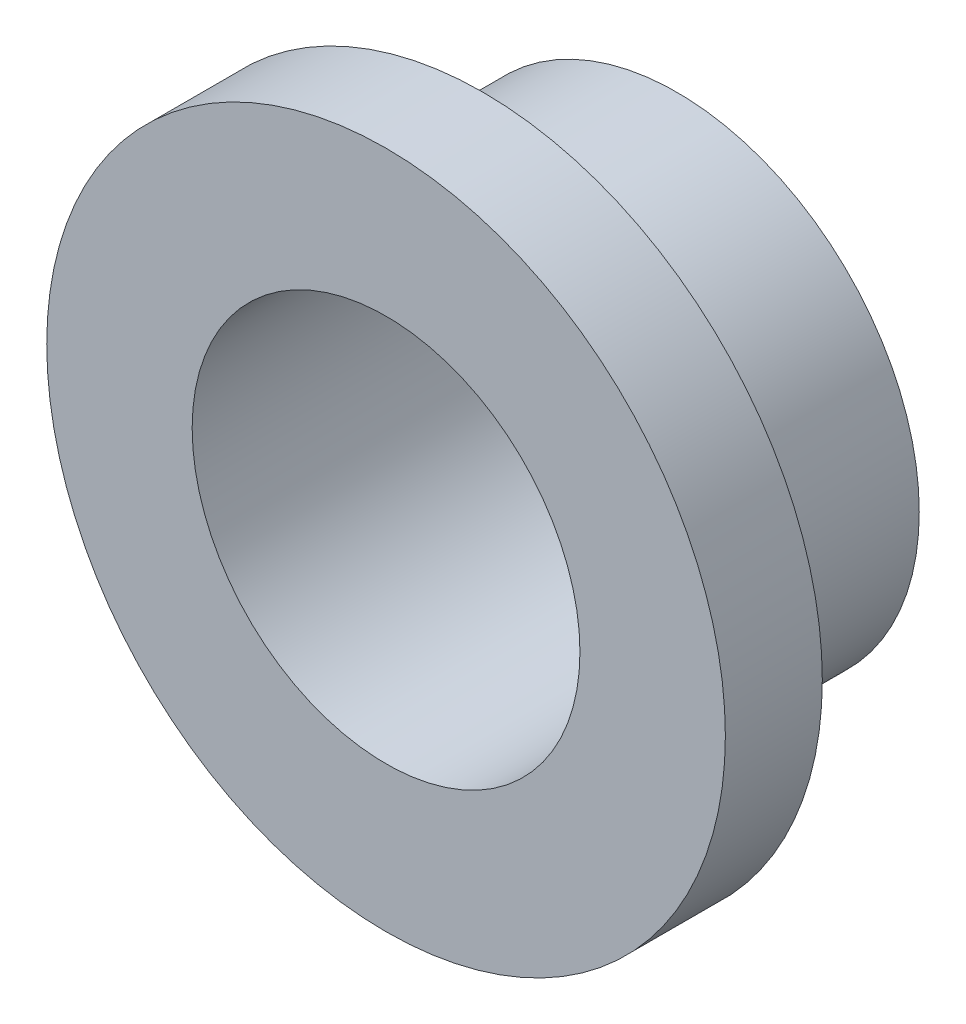
ISO-10303-21;
HEADER;
FILE_DESCRIPTION(('STEP AP214'),'2;1');
FILE_NAME('part.step','',(''),(''),'','','');
FILE_SCHEMA(('AUTOMOTIVE_DESIGN { 1 0 10303 214 1 1 1 1 }'));
ENDSEC;
DATA;
#1=APPLICATION_CONTEXT('core data for automotive mechanical design processes');
#2=APPLICATION_PROTOCOL_DEFINITION('international standard','automotive_design',2000,#1);
#3=PRODUCT_CONTEXT('',#1,'mechanical');
#4=PRODUCT('Part','Part','',(#3));
#5=PRODUCT_RELATED_PRODUCT_CATEGORY('part','',(#4));
#6=PRODUCT_DEFINITION_FORMATION('','',#4);
#7=PRODUCT_DEFINITION_CONTEXT('part definition',#1,'design');
#8=PRODUCT_DEFINITION('design','',#6,#7);
#9=PRODUCT_DEFINITION_SHAPE('','',#8);
#10=(LENGTH_UNIT() NAMED_UNIT(*) SI_UNIT(.MILLI.,.METRE.));
#11=(NAMED_UNIT(*) PLANE_ANGLE_UNIT() SI_UNIT($,.RADIAN.));
#12=(NAMED_UNIT(*) SI_UNIT($,.STERADIAN.) SOLID_ANGLE_UNIT());
#13=UNCERTAINTY_MEASURE_WITH_UNIT(LENGTH_MEASURE(1.E-05),#10,'distance_accuracy_value','');
#14=(GEOMETRIC_REPRESENTATION_CONTEXT(3) GLOBAL_UNCERTAINTY_ASSIGNED_CONTEXT((#13)) GLOBAL_UNIT_ASSIGNED_CONTEXT((#10,
#11,#12)) REPRESENTATION_CONTEXT('',''));
#15=CARTESIAN_POINT('',(0.,0.,0.));
#16=DIRECTION('',(0.,0.,1.));
#17=DIRECTION('',(1.,0.,0.));
#18=AXIS2_PLACEMENT_3D('',#15,#16,#17);
#19=CARTESIAN_POINT('',(0.,0.,9.525));
#20=DIRECTION('',(0.,0.,-1.));
#21=DIRECTION('',(-1.,0.,0.));
#22=AXIS2_PLACEMENT_3D('',#19,#20,#21);
#23=CYLINDRICAL_SURFACE('',#22,7.9375);
#24=CARTESIAN_POINT('',(0.,0.,0.));
#25=DIRECTION('',(0.,0.,1.));
#26=DIRECTION('',(1.,0.,0.));
#27=AXIS2_PLACEMENT_3D('',#24,#25,#26);
#28=CIRCLE('',#27,7.9375);
#29=CARTESIAN_POINT('',(7.9375,0.,0.));
#30=VERTEX_POINT('',#29);
#31=EDGE_CURVE('E34',#30,#30,#28,.T.);
#32=ORIENTED_EDGE('',*,*,#31,.T.);
#33=EDGE_LOOP('',(#32));
#34=FACE_BOUND('',#33,.T.);
#35=CARTESIAN_POINT('',(0.,0.,6.35));
#36=DIRECTION('',(0.,0.,1.));
#37=DIRECTION('',(1.,0.,0.));
#38=AXIS2_PLACEMENT_3D('',#35,#36,#37);
#39=CIRCLE('',#38,7.9375);
#40=CARTESIAN_POINT('',(7.9375,0.,6.35));
#41=VERTEX_POINT('',#40);
#42=EDGE_CURVE('E10',#41,#41,#39,.T.);
#43=ORIENTED_EDGE('',*,*,#42,.F.);
#44=EDGE_LOOP('',(#43));
#45=FACE_BOUND('',#44,.T.);
#46=ADVANCED_FACE('F31',(#34,#45),#23,.T.);
#47=CARTESIAN_POINT('',(0.,0.,9.525));
#48=DIRECTION('',(0.,0.,1.));
#49=DIRECTION('',(1.,0.,0.));
#50=AXIS2_PLACEMENT_3D('',#47,#48,#49);
#51=PLANE('',#50);
#52=CARTESIAN_POINT('',(0.,0.,9.525));
#53=DIRECTION('',(0.,0.,1.));
#54=DIRECTION('',(1.,0.,0.));
#55=AXIS2_PLACEMENT_3D('',#52,#53,#54);
#56=CIRCLE('',#55,6.35);
#57=CARTESIAN_POINT('',(6.35,0.,9.525));
#58=VERTEX_POINT('',#57);
#59=EDGE_CURVE('E42',#58,#58,#56,.T.);
#60=ORIENTED_EDGE('',*,*,#59,.F.);
#61=EDGE_LOOP('',(#60));
#62=FACE_BOUND('',#61,.T.);
#63=CARTESIAN_POINT('',(0.,0.,9.525));
#64=DIRECTION('',(0.,0.,1.));
#65=DIRECTION('',(1.,0.,0.));
#66=AXIS2_PLACEMENT_3D('',#63,#64,#65);
#67=CIRCLE('',#66,11.1125);
#68=CARTESIAN_POINT('',(11.1125,0.,9.525));
#69=VERTEX_POINT('',#68);
#70=EDGE_CURVE('E45',#69,#69,#67,.T.);
#71=ORIENTED_EDGE('',*,*,#70,.T.);
#72=EDGE_LOOP('',(#71));
#73=FACE_BOUND('',#72,.T.);
#74=ADVANCED_FACE('F59',(#62,#73),#51,.T.);
#75=CARTESIAN_POINT('',(0.,0.,0.));
#76=DIRECTION('',(0.,0.,1.));
#77=DIRECTION('',(1.,0.,0.));
#78=AXIS2_PLACEMENT_3D('',#75,#76,#77);
#79=PLANE('',#78);
#80=ORIENTED_EDGE('',*,*,#31,.F.);
#81=EDGE_LOOP('',(#80));
#82=FACE_BOUND('',#81,.T.);
#83=CARTESIAN_POINT('',(0.,0.,0.));
#84=DIRECTION('',(0.,0.,1.));
#85=DIRECTION('',(1.,0.,0.));
#86=AXIS2_PLACEMENT_3D('',#83,#84,#85);
#87=CIRCLE('',#86,6.35);
#88=CARTESIAN_POINT('',(6.35,0.,0.));
#89=VERTEX_POINT('',#88);
#90=EDGE_CURVE('E48',#89,#89,#87,.T.);
#91=ORIENTED_EDGE('',*,*,#90,.T.);
#92=EDGE_LOOP('',(#91));
#93=FACE_BOUND('',#92,.T.);
#94=ADVANCED_FACE('F77',(#82,#93),#79,.F.);
#95=CARTESIAN_POINT('',(0.,0.,9.525));
#96=DIRECTION('',(0.,0.,-1.));
#97=DIRECTION('',(-1.,0.,0.));
#98=AXIS2_PLACEMENT_3D('',#95,#96,#97);
#99=CYLINDRICAL_SURFACE('',#98,6.35);
#100=ORIENTED_EDGE('',*,*,#59,.T.);
#101=EDGE_LOOP('',(#100));
#102=FACE_BOUND('',#101,.T.);
#103=ORIENTED_EDGE('',*,*,#90,.F.);
#104=EDGE_LOOP('',(#103));
#105=FACE_BOUND('',#104,.T.);
#106=ADVANCED_FACE('F68',(#102,#105),#99,.F.);
#107=CARTESIAN_POINT('',(0.,0.,6.35));
#108=DIRECTION('',(0.,0.,1.));
#109=DIRECTION('',(1.,0.,0.));
#110=AXIS2_PLACEMENT_3D('',#107,#108,#109);
#111=PLANE('',#110);
#112=CARTESIAN_POINT('',(0.,0.,6.35));
#113=DIRECTION('',(0.,0.,1.));
#114=DIRECTION('',(1.,0.,0.));
#115=AXIS2_PLACEMENT_3D('',#112,#113,#114);
#116=CIRCLE('',#115,11.1125);
#117=CARTESIAN_POINT('',(11.1125,0.,6.35));
#118=VERTEX_POINT('',#117);
#119=EDGE_CURVE('E50',#118,#118,#116,.T.);
#120=ORIENTED_EDGE('',*,*,#119,.F.);
#121=EDGE_LOOP('',(#120));
#122=FACE_BOUND('',#121,.T.);
#123=ORIENTED_EDGE('',*,*,#42,.T.);
#124=EDGE_LOOP('',(#123));
#125=FACE_BOUND('',#124,.T.);
#126=ADVANCED_FACE('F63',(#122,#125),#111,.F.);
#127=CARTESIAN_POINT('',(0.,0.,6.35));
#128=DIRECTION('',(0.,0.,1.));
#129=DIRECTION('',(1.,0.,0.));
#130=AXIS2_PLACEMENT_3D('',#127,#128,#129);
#131=CYLINDRICAL_SURFACE('',#130,11.1125);
#132=ORIENTED_EDGE('',*,*,#119,.T.);
#133=EDGE_LOOP('',(#132));
#134=FACE_BOUND('',#133,.T.);
#135=ORIENTED_EDGE('',*,*,#70,.F.);
#136=EDGE_LOOP('',(#135));
#137=FACE_BOUND('',#136,.T.);
#138=ADVANCED_FACE('F61',(#134,#137),#131,.T.);
#139=CLOSED_SHELL('',(#46,#74,#94,#106,#126,#138));
#140=MANIFOLD_SOLID_BREP('B2',#139);
#141=ADVANCED_BREP_SHAPE_REPRESENTATION('',(#18,#140),#14);
#142=SHAPE_DEFINITION_REPRESENTATION(#9,#141);
ENDSEC;
END-ISO-10303-21;
